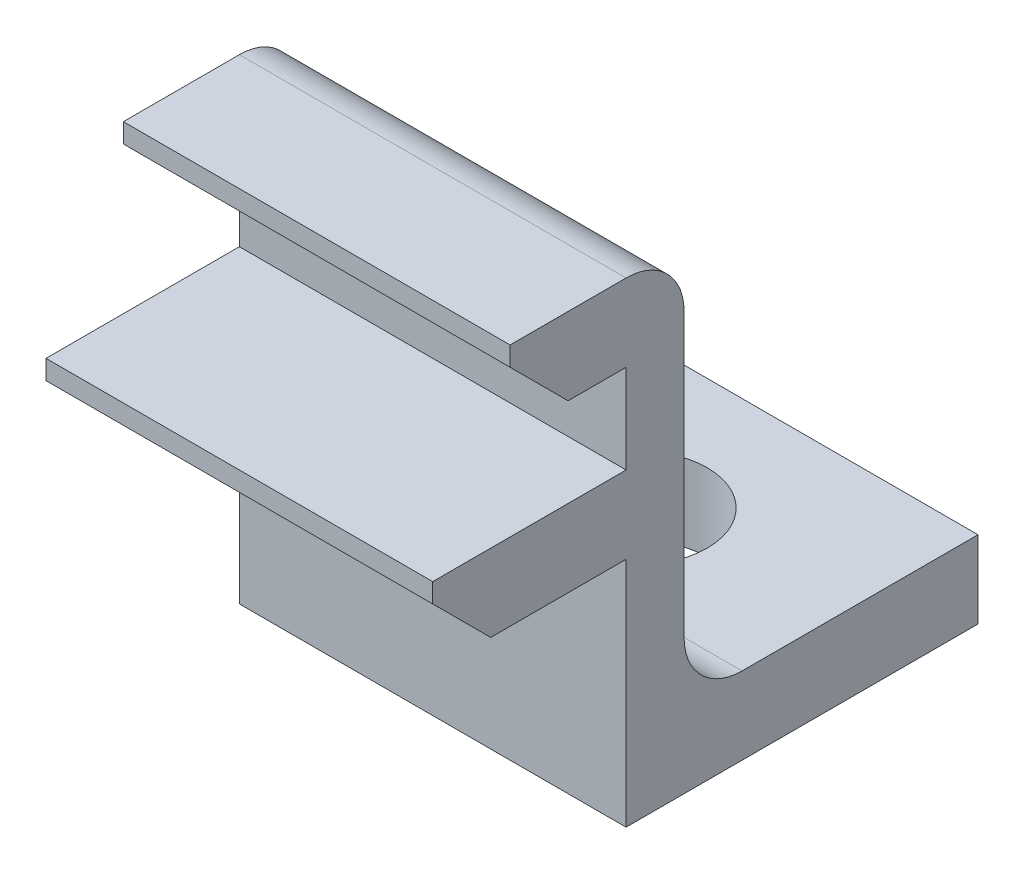
ISO-10303-21;
HEADER;
FILE_DESCRIPTION(('STEP AP214'),'2;1');
FILE_NAME('part.step','',(''),(''),'','','');
FILE_SCHEMA(('AUTOMOTIVE_DESIGN { 1 0 10303 214 1 1 1 1 }'));
ENDSEC;
DATA;
#1=APPLICATION_CONTEXT('core data for automotive mechanical design processes');
#2=APPLICATION_PROTOCOL_DEFINITION('international standard','automotive_design',2000,#1);
#3=PRODUCT_CONTEXT('',#1,'mechanical');
#4=PRODUCT('Part','Part','',(#3));
#5=PRODUCT_RELATED_PRODUCT_CATEGORY('part','',(#4));
#6=PRODUCT_DEFINITION_FORMATION('','',#4);
#7=PRODUCT_DEFINITION_CONTEXT('part definition',#1,'design');
#8=PRODUCT_DEFINITION('design','',#6,#7);
#9=PRODUCT_DEFINITION_SHAPE('','',#8);
#10=(LENGTH_UNIT() NAMED_UNIT(*) SI_UNIT(.MILLI.,.METRE.));
#11=(NAMED_UNIT(*) PLANE_ANGLE_UNIT() SI_UNIT($,.RADIAN.));
#12=(NAMED_UNIT(*) SI_UNIT($,.STERADIAN.) SOLID_ANGLE_UNIT());
#13=UNCERTAINTY_MEASURE_WITH_UNIT(LENGTH_MEASURE(1.E-05),#10,'distance_accuracy_value','');
#14=(GEOMETRIC_REPRESENTATION_CONTEXT(3) GLOBAL_UNCERTAINTY_ASSIGNED_CONTEXT((#13)) GLOBAL_UNIT_ASSIGNED_CONTEXT((#10,
#11,#12)) REPRESENTATION_CONTEXT('',''));
#15=CARTESIAN_POINT('',(0.,0.,0.));
#16=DIRECTION('',(0.,0.,1.));
#17=DIRECTION('',(1.,0.,0.));
#18=AXIS2_PLACEMENT_3D('',#15,#16,#17);
#19=CARTESIAN_POINT('',(5.,0.,-3.79999999999999));
#20=DIRECTION('',(0.,0.,-1.));
#21=DIRECTION('',(0.,1.,0.));
#22=AXIS2_PLACEMENT_3D('',#19,#20,#21);
#23=PLANE('',#22);
#24=DIRECTION('',(0.,-1.,0.));
#25=VECTOR('',#24,1.);
#26=CARTESIAN_POINT('',(-5.,0.,-3.79999999999999));
#27=LINE('',#26,#25);
#28=CARTESIAN_POINT('',(-5.,-5.15,-3.8));
#29=VERTEX_POINT('',#28);
#30=CARTESIAN_POINT('',(-5.,-7.15,-3.8));
#31=VERTEX_POINT('',#30);
#32=EDGE_CURVE('E177',#29,#31,#27,.T.);
#33=ORIENTED_EDGE('',*,*,#32,.F.);
#34=DIRECTION('',(-1.,0.,0.));
#35=VECTOR('',#34,1.);
#36=CARTESIAN_POINT('',(5.,-5.15,-3.8));
#37=LINE('',#36,#35);
#38=CARTESIAN_POINT('',(5.,-5.15,-3.8));
#39=VERTEX_POINT('',#38);
#40=EDGE_CURVE('E165',#39,#29,#37,.T.);
#41=ORIENTED_EDGE('',*,*,#40,.F.);
#42=DIRECTION('',(0.,-1.,0.));
#43=VECTOR('',#42,1.);
#44=CARTESIAN_POINT('',(5.,0.,-3.79999999999999));
#45=LINE('',#44,#43);
#46=CARTESIAN_POINT('',(5.,-7.15,-3.8));
#47=VERTEX_POINT('',#46);
#48=EDGE_CURVE('E172',#39,#47,#45,.T.);
#49=ORIENTED_EDGE('',*,*,#48,.T.);
#50=DIRECTION('',(-1.,0.,0.));
#51=VECTOR('',#50,1.);
#52=CARTESIAN_POINT('',(5.,-7.15,-3.8));
#53=LINE('',#52,#51);
#54=EDGE_CURVE('E216',#47,#31,#53,.T.);
#55=ORIENTED_EDGE('',*,*,#54,.T.);
#56=EDGE_LOOP('',(#33,#41,#49,#55));
#57=FACE_BOUND('',#56,.T.);
#58=ADVANCED_FACE('F46',(#57),#23,.T.);
#59=CARTESIAN_POINT('',(5.,-5.15,0.));
#60=DIRECTION('',(0.,1.,0.));
#61=DIRECTION('',(0.,0.,1.));
#62=AXIS2_PLACEMENT_3D('',#59,#60,#61);
#63=PLANE('',#62);
#64=CARTESIAN_POINT('',(0.,-5.15,0.));
#65=DIRECTION('',(0.,1.,0.));
#66=DIRECTION('',(0.,0.,1.));
#67=AXIS2_PLACEMENT_3D('',#64,#65,#66);
#68=CIRCLE('',#67,1.8);
#69=CARTESIAN_POINT('',(0.,-5.15,1.8));
#70=VERTEX_POINT('',#69);
#71=EDGE_CURVE('E191',#70,#70,#68,.T.);
#72=ORIENTED_EDGE('',*,*,#71,.F.);
#73=EDGE_LOOP('',(#72));
#74=FACE_BOUND('',#73,.T.);
#75=DIRECTION('',(0.,0.,-1.));
#76=VECTOR('',#75,1.);
#77=CARTESIAN_POINT('',(-5.,-5.15,0.));
#78=LINE('',#77,#76);
#79=CARTESIAN_POINT('',(-5.,-5.15,2.3));
#80=VERTEX_POINT('',#79);
#81=EDGE_CURVE('E218',#80,#29,#78,.T.);
#82=ORIENTED_EDGE('',*,*,#81,.F.);
#83=DIRECTION('',(-1.,0.,0.));
#84=VECTOR('',#83,1.);
#85=CARTESIAN_POINT('',(5.,-5.15,2.3));
#86=LINE('',#85,#84);
#87=CARTESIAN_POINT('',(5.,-5.15,2.3));
#88=VERTEX_POINT('',#87);
#89=EDGE_CURVE('E168',#80,#88,#86,.F.);
#90=ORIENTED_EDGE('',*,*,#89,.T.);
#91=DIRECTION('',(0.,0.,-1.));
#92=VECTOR('',#91,1.);
#93=CARTESIAN_POINT('',(5.,-5.15,0.));
#94=LINE('',#93,#92);
#95=EDGE_CURVE('E161',#88,#39,#94,.T.);
#96=ORIENTED_EDGE('',*,*,#95,.T.);
#97=ORIENTED_EDGE('',*,*,#40,.T.);
#98=EDGE_LOOP('',(#82,#90,#96,#97));
#99=FACE_BOUND('',#98,.T.);
#100=ADVANCED_FACE('F164',(#74,#99),#63,.T.);
#101=CARTESIAN_POINT('',(5.,0.,3.8));
#102=DIRECTION('',(0.,0.,-1.));
#103=DIRECTION('',(-1.,0.,0.));
#104=AXIS2_PLACEMENT_3D('',#101,#102,#103);
#105=PLANE('',#104);
#106=DIRECTION('',(0.,-1.,0.));
#107=VECTOR('',#106,1.);
#108=CARTESIAN_POINT('',(5.,0.,3.8));
#109=LINE('',#108,#107);
#110=CARTESIAN_POINT('',(5.,3.65,3.8));
#111=VERTEX_POINT('',#110);
#112=CARTESIAN_POINT('',(5.,-3.65,3.8));
#113=VERTEX_POINT('',#112);
#114=EDGE_CURVE('E171',#111,#113,#109,.T.);
#115=ORIENTED_EDGE('',*,*,#114,.T.);
#116=DIRECTION('',(-1.,0.,0.));
#117=VECTOR('',#116,1.);
#118=CARTESIAN_POINT('',(-5.,-3.65,3.8));
#119=LINE('',#118,#117);
#120=CARTESIAN_POINT('',(-5.,-3.65,3.8));
#121=VERTEX_POINT('',#120);
#122=EDGE_CURVE('E277',#113,#121,#119,.T.);
#123=ORIENTED_EDGE('',*,*,#122,.T.);
#124=DIRECTION('',(0.,-1.,0.));
#125=VECTOR('',#124,1.);
#126=CARTESIAN_POINT('',(-5.,0.,3.8));
#127=LINE('',#126,#125);
#128=CARTESIAN_POINT('',(-5.,3.65,3.8));
#129=VERTEX_POINT('',#128);
#130=EDGE_CURVE('E220',#129,#121,#127,.T.);
#131=ORIENTED_EDGE('',*,*,#130,.F.);
#132=DIRECTION('',(-1.,0.,0.));
#133=VECTOR('',#132,1.);
#134=CARTESIAN_POINT('',(5.,3.65,3.8));
#135=LINE('',#134,#133);
#136=EDGE_CURVE('E275',#129,#111,#135,.F.);
#137=ORIENTED_EDGE('',*,*,#136,.T.);
#138=EDGE_LOOP('',(#115,#123,#131,#137));
#139=FACE_BOUND('',#138,.T.);
#140=ADVANCED_FACE('F291',(#139),#105,.T.);
#141=CARTESIAN_POINT('',(5.,5.15,0.));
#142=DIRECTION('',(0.,1.,0.));
#143=DIRECTION('',(0.,0.,1.));
#144=AXIS2_PLACEMENT_3D('',#141,#142,#143);
#145=PLANE('',#144);
#146=DIRECTION('',(0.,0.,-1.));
#147=VECTOR('',#146,1.);
#148=CARTESIAN_POINT('',(5.,5.15,0.));
#149=LINE('',#148,#147);
#150=CARTESIAN_POINT('',(5.,5.15,8.3));
#151=VERTEX_POINT('',#150);
#152=CARTESIAN_POINT('',(5.,5.15,5.3));
#153=VERTEX_POINT('',#152);
#154=EDGE_CURVE('E196',#151,#153,#149,.T.);
#155=ORIENTED_EDGE('',*,*,#154,.T.);
#156=DIRECTION('',(-1.,0.,0.));
#157=VECTOR('',#156,1.);
#158=CARTESIAN_POINT('',(5.,5.15,5.3));
#159=LINE('',#158,#157);
#160=CARTESIAN_POINT('',(-5.,5.15,5.3));
#161=VERTEX_POINT('',#160);
#162=EDGE_CURVE('E281',#153,#161,#159,.T.);
#163=ORIENTED_EDGE('',*,*,#162,.T.);
#164=DIRECTION('',(0.,0.,-1.));
#165=VECTOR('',#164,1.);
#166=CARTESIAN_POINT('',(-5.,5.15,0.));
#167=LINE('',#166,#165);
#168=CARTESIAN_POINT('',(-5.,5.15,8.3));
#169=VERTEX_POINT('',#168);
#170=EDGE_CURVE('E223',#169,#161,#167,.T.);
#171=ORIENTED_EDGE('',*,*,#170,.F.);
#172=DIRECTION('',(-1.,0.,0.));
#173=VECTOR('',#172,1.);
#174=CARTESIAN_POINT('',(5.,5.15,8.3));
#175=LINE('',#174,#173);
#176=EDGE_CURVE('E179',#151,#169,#175,.T.);
#177=ORIENTED_EDGE('',*,*,#176,.F.);
#178=EDGE_LOOP('',(#155,#163,#171,#177));
#179=FACE_BOUND('',#178,.T.);
#180=ADVANCED_FACE('F294',(#179),#145,.T.);
#181=CARTESIAN_POINT('',(5.,0.,8.3));
#182=DIRECTION('',(0.,0.,-1.));
#183=DIRECTION('',(-1.,0.,0.));
#184=AXIS2_PLACEMENT_3D('',#181,#182,#183);
#185=PLANE('',#184);
#186=DIRECTION('',(0.,-1.,0.));
#187=VECTOR('',#186,1.);
#188=CARTESIAN_POINT('',(-5.,0.,8.3));
#189=LINE('',#188,#187);
#190=CARTESIAN_POINT('',(-5.,4.65000000000001,8.3));
#191=VERTEX_POINT('',#190);
#192=EDGE_CURVE('E226',#169,#191,#189,.T.);
#193=ORIENTED_EDGE('',*,*,#192,.T.);
#194=DIRECTION('',(1.,0.,0.));
#195=VECTOR('',#194,1.);
#196=CARTESIAN_POINT('',(5.,4.65000000000001,8.3));
#197=LINE('',#196,#195);
#198=CARTESIAN_POINT('',(5.,4.65000000000001,8.3));
#199=VERTEX_POINT('',#198);
#200=EDGE_CURVE('E264',#191,#199,#197,.T.);
#201=ORIENTED_EDGE('',*,*,#200,.T.);
#202=DIRECTION('',(0.,-1.,0.));
#203=VECTOR('',#202,1.);
#204=CARTESIAN_POINT('',(5.,0.,8.3));
#205=LINE('',#204,#203);
#206=EDGE_CURVE('E198',#151,#199,#205,.T.);
#207=ORIENTED_EDGE('',*,*,#206,.F.);
#208=ORIENTED_EDGE('',*,*,#176,.T.);
#209=EDGE_LOOP('',(#193,#201,#207,#208));
#210=FACE_BOUND('',#209,.T.);
#211=ADVANCED_FACE('F299',(#210),#185,.F.);
#212=CARTESIAN_POINT('',(5.,3.15,0.));
#213=DIRECTION('',(0.,1.,0.));
#214=DIRECTION('',(0.,0.,1.));
#215=AXIS2_PLACEMENT_3D('',#212,#213,#214);
#216=PLANE('',#215);
#217=DIRECTION('',(0.,0.,-1.));
#218=VECTOR('',#217,1.);
#219=CARTESIAN_POINT('',(5.,3.15,0.));
#220=LINE('',#219,#218);
#221=CARTESIAN_POINT('',(5.,3.15,6.8));
#222=VERTEX_POINT('',#221);
#223=CARTESIAN_POINT('',(5.,3.15,5.3));
#224=VERTEX_POINT('',#223);
#225=EDGE_CURVE('E201',#222,#224,#220,.T.);
#226=ORIENTED_EDGE('',*,*,#225,.F.);
#227=DIRECTION('',(-1.,0.,0.));
#228=VECTOR('',#227,1.);
#229=CARTESIAN_POINT('',(5.,3.15,6.8));
#230=LINE('',#229,#228);
#231=CARTESIAN_POINT('',(-5.,3.15,6.8));
#232=VERTEX_POINT('',#231);
#233=EDGE_CURVE('E178',#222,#232,#230,.T.);
#234=ORIENTED_EDGE('',*,*,#233,.T.);
#235=DIRECTION('',(0.,0.,-1.));
#236=VECTOR('',#235,1.);
#237=CARTESIAN_POINT('',(-5.,3.15,0.));
#238=LINE('',#237,#236);
#239=CARTESIAN_POINT('',(-5.,3.15,5.3));
#240=VERTEX_POINT('',#239);
#241=EDGE_CURVE('E229',#232,#240,#238,.T.);
#242=ORIENTED_EDGE('',*,*,#241,.T.);
#243=DIRECTION('',(-1.,0.,0.));
#244=VECTOR('',#243,1.);
#245=CARTESIAN_POINT('',(5.,3.15,5.3));
#246=LINE('',#245,#244);
#247=EDGE_CURVE('E254',#224,#240,#246,.T.);
#248=ORIENTED_EDGE('',*,*,#247,.F.);
#249=EDGE_LOOP('',(#226,#234,#242,#248));
#250=FACE_BOUND('',#249,.T.);
#251=ADVANCED_FACE('F308',(#250),#216,.F.);
#252=CARTESIAN_POINT('',(5.,0.,5.3));
#253=DIRECTION('',(0.,0.,-1.));
#254=DIRECTION('',(0.,1.,0.));
#255=AXIS2_PLACEMENT_3D('',#252,#253,#254);
#256=PLANE('',#255);
#257=DIRECTION('',(0.,-1.,0.));
#258=VECTOR('',#257,1.);
#259=CARTESIAN_POINT('',(-5.,0.,5.3));
#260=LINE('',#259,#258);
#261=CARTESIAN_POINT('',(-5.,0.850000000000001,5.3));
#262=VERTEX_POINT('',#261);
#263=EDGE_CURVE('E231',#240,#262,#260,.T.);
#264=ORIENTED_EDGE('',*,*,#263,.T.);
#265=DIRECTION('',(-1.,0.,0.));
#266=VECTOR('',#265,1.);
#267=CARTESIAN_POINT('',(5.,0.850000000000001,5.3));
#268=LINE('',#267,#266);
#269=CARTESIAN_POINT('',(5.,0.850000000000001,5.3));
#270=VERTEX_POINT('',#269);
#271=EDGE_CURVE('E252',#270,#262,#268,.T.);
#272=ORIENTED_EDGE('',*,*,#271,.F.);
#273=DIRECTION('',(0.,-1.,0.));
#274=VECTOR('',#273,1.);
#275=CARTESIAN_POINT('',(5.,0.,5.3));
#276=LINE('',#275,#274);
#277=EDGE_CURVE('E203',#224,#270,#276,.T.);
#278=ORIENTED_EDGE('',*,*,#277,.F.);
#279=ORIENTED_EDGE('',*,*,#247,.T.);
#280=EDGE_LOOP('',(#264,#272,#278,#279));
#281=FACE_BOUND('',#280,.T.);
#282=ADVANCED_FACE('F313',(#281),#256,.F.);
#283=CARTESIAN_POINT('',(5.,0.850000000000001,0.));
#284=DIRECTION('',(0.,1.,0.));
#285=DIRECTION('',(0.,0.,1.));
#286=AXIS2_PLACEMENT_3D('',#283,#284,#285);
#287=PLANE('',#286);
#288=DIRECTION('',(0.,0.,-1.));
#289=VECTOR('',#288,1.);
#290=CARTESIAN_POINT('',(-5.,0.850000000000001,0.));
#291=LINE('',#290,#289);
#292=CARTESIAN_POINT('',(-5.,0.850000000000001,10.3));
#293=VERTEX_POINT('',#292);
#294=EDGE_CURVE('E234',#293,#262,#291,.T.);
#295=ORIENTED_EDGE('',*,*,#294,.F.);
#296=DIRECTION('',(-1.,0.,0.));
#297=VECTOR('',#296,1.);
#298=CARTESIAN_POINT('',(5.,0.850000000000001,10.3));
#299=LINE('',#298,#297);
#300=CARTESIAN_POINT('',(5.,0.850000000000001,10.3));
#301=VERTEX_POINT('',#300);
#302=EDGE_CURVE('E250',#301,#293,#299,.T.);
#303=ORIENTED_EDGE('',*,*,#302,.F.);
#304=DIRECTION('',(0.,0.,-1.));
#305=VECTOR('',#304,1.);
#306=CARTESIAN_POINT('',(5.,0.850000000000001,0.));
#307=LINE('',#306,#305);
#308=EDGE_CURVE('E205',#301,#270,#307,.T.);
#309=ORIENTED_EDGE('',*,*,#308,.T.);
#310=ORIENTED_EDGE('',*,*,#271,.T.);
#311=EDGE_LOOP('',(#295,#303,#309,#310));
#312=FACE_BOUND('',#311,.T.);
#313=ADVANCED_FACE('F319',(#312),#287,.T.);
#314=CARTESIAN_POINT('',(5.,0.,10.3));
#315=DIRECTION('',(0.,0.,-1.));
#316=DIRECTION('',(0.,1.,0.));
#317=AXIS2_PLACEMENT_3D('',#314,#315,#316);
#318=PLANE('',#317);
#319=DIRECTION('',(0.,-1.,0.));
#320=VECTOR('',#319,1.);
#321=CARTESIAN_POINT('',(-5.,0.,10.3));
#322=LINE('',#321,#320);
#323=CARTESIAN_POINT('',(-5.,0.350000000000008,10.3));
#324=VERTEX_POINT('',#323);
#325=EDGE_CURVE('E237',#293,#324,#322,.T.);
#326=ORIENTED_EDGE('',*,*,#325,.T.);
#327=DIRECTION('',(1.,0.,0.));
#328=VECTOR('',#327,1.);
#329=CARTESIAN_POINT('',(5.,0.350000000000008,10.3));
#330=LINE('',#329,#328);
#331=CARTESIAN_POINT('',(5.,0.350000000000008,10.3));
#332=VERTEX_POINT('',#331);
#333=EDGE_CURVE('E273',#324,#332,#330,.T.);
#334=ORIENTED_EDGE('',*,*,#333,.T.);
#335=DIRECTION('',(0.,-1.,0.));
#336=VECTOR('',#335,1.);
#337=CARTESIAN_POINT('',(5.,0.,10.3));
#338=LINE('',#337,#336);
#339=EDGE_CURVE('E208',#301,#332,#338,.T.);
#340=ORIENTED_EDGE('',*,*,#339,.F.);
#341=ORIENTED_EDGE('',*,*,#302,.T.);
#342=EDGE_LOOP('',(#326,#334,#340,#341));
#343=FACE_BOUND('',#342,.T.);
#344=ADVANCED_FACE('F322',(#343),#318,.F.);
#345=CARTESIAN_POINT('',(5.,-1.15,0.));
#346=DIRECTION('',(0.,1.,0.));
#347=DIRECTION('',(0.,0.,1.));
#348=AXIS2_PLACEMENT_3D('',#345,#346,#347);
#349=PLANE('',#348);
#350=DIRECTION('',(0.,0.,-1.));
#351=VECTOR('',#350,1.);
#352=CARTESIAN_POINT('',(5.,-1.15,0.));
#353=LINE('',#352,#351);
#354=CARTESIAN_POINT('',(5.,-1.15,8.8));
#355=VERTEX_POINT('',#354);
#356=CARTESIAN_POINT('',(5.,-1.15,5.3));
#357=VERTEX_POINT('',#356);
#358=EDGE_CURVE('E211',#355,#357,#353,.T.);
#359=ORIENTED_EDGE('',*,*,#358,.F.);
#360=DIRECTION('',(-1.,0.,0.));
#361=VECTOR('',#360,1.);
#362=CARTESIAN_POINT('',(5.,-1.15,8.8));
#363=LINE('',#362,#361);
#364=CARTESIAN_POINT('',(-5.,-1.15,8.8));
#365=VERTEX_POINT('',#364);
#366=EDGE_CURVE('E270',#355,#365,#363,.T.);
#367=ORIENTED_EDGE('',*,*,#366,.T.);
#368=DIRECTION('',(0.,0.,-1.));
#369=VECTOR('',#368,1.);
#370=CARTESIAN_POINT('',(-5.,-1.15,0.));
#371=LINE('',#370,#369);
#372=CARTESIAN_POINT('',(-5.,-1.15,5.3));
#373=VERTEX_POINT('',#372);
#374=EDGE_CURVE('E240',#365,#373,#371,.T.);
#375=ORIENTED_EDGE('',*,*,#374,.T.);
#376=DIRECTION('',(-1.,0.,0.));
#377=VECTOR('',#376,1.);
#378=CARTESIAN_POINT('',(5.,-1.15,5.3));
#379=LINE('',#378,#377);
#380=EDGE_CURVE('E247',#357,#373,#379,.T.);
#381=ORIENTED_EDGE('',*,*,#380,.F.);
#382=EDGE_LOOP('',(#359,#367,#375,#381));
#383=FACE_BOUND('',#382,.T.);
#384=ADVANCED_FACE('F330',(#383),#349,.F.);
#385=CARTESIAN_POINT('',(5.,0.,5.3));
#386=DIRECTION('',(0.,0.,-1.));
#387=DIRECTION('',(0.,1.,0.));
#388=AXIS2_PLACEMENT_3D('',#385,#386,#387);
#389=PLANE('',#388);
#390=DIRECTION('',(0.,-1.,0.));
#391=VECTOR('',#390,1.);
#392=CARTESIAN_POINT('',(-5.,0.,5.3));
#393=LINE('',#392,#391);
#394=CARTESIAN_POINT('',(-5.,-7.15,5.3));
#395=VERTEX_POINT('',#394);
#396=EDGE_CURVE('E188',#373,#395,#393,.T.);
#397=ORIENTED_EDGE('',*,*,#396,.T.);
#398=DIRECTION('',(-1.,0.,0.));
#399=VECTOR('',#398,1.);
#400=CARTESIAN_POINT('',(5.,-7.15,5.3));
#401=LINE('',#400,#399);
#402=CARTESIAN_POINT('',(5.,-7.15,5.3));
#403=VERTEX_POINT('',#402);
#404=EDGE_CURVE('E244',#403,#395,#401,.T.);
#405=ORIENTED_EDGE('',*,*,#404,.F.);
#406=DIRECTION('',(0.,-1.,0.));
#407=VECTOR('',#406,1.);
#408=CARTESIAN_POINT('',(5.,0.,5.3));
#409=LINE('',#408,#407);
#410=EDGE_CURVE('E213',#357,#403,#409,.T.);
#411=ORIENTED_EDGE('',*,*,#410,.F.);
#412=ORIENTED_EDGE('',*,*,#380,.T.);
#413=EDGE_LOOP('',(#397,#405,#411,#412));
#414=FACE_BOUND('',#413,.T.);
#415=ADVANCED_FACE('F336',(#414),#389,.F.);
#416=CARTESIAN_POINT('',(5.,-7.15,0.));
#417=DIRECTION('',(0.,1.,0.));
#418=DIRECTION('',(0.,0.,1.));
#419=AXIS2_PLACEMENT_3D('',#416,#417,#418);
#420=PLANE('',#419);
#421=CARTESIAN_POINT('',(0.,-7.15,0.));
#422=DIRECTION('',(0.,-1.,0.));
#423=DIRECTION('',(0.,0.,-1.));
#424=AXIS2_PLACEMENT_3D('',#421,#422,#423);
#425=CIRCLE('',#424,1.8);
#426=CARTESIAN_POINT('',(0.,-7.15,-1.8));
#427=VERTEX_POINT('',#426);
#428=EDGE_CURVE('E506',#427,#427,#425,.T.);
#429=ORIENTED_EDGE('',*,*,#428,.F.);
#430=EDGE_LOOP('',(#429));
#431=FACE_BOUND('',#430,.T.);
#432=DIRECTION('',(0.,0.,-1.));
#433=VECTOR('',#432,1.);
#434=CARTESIAN_POINT('',(-5.,-7.15,0.));
#435=LINE('',#434,#433);
#436=EDGE_CURVE('E185',#395,#31,#435,.T.);
#437=ORIENTED_EDGE('',*,*,#436,.T.);
#438=ORIENTED_EDGE('',*,*,#54,.F.);
#439=DIRECTION('',(0.,0.,-1.));
#440=VECTOR('',#439,1.);
#441=CARTESIAN_POINT('',(5.,-7.15,0.));
#442=LINE('',#441,#440);
#443=EDGE_CURVE('E183',#403,#47,#442,.T.);
#444=ORIENTED_EDGE('',*,*,#443,.F.);
#445=ORIENTED_EDGE('',*,*,#404,.T.);
#446=EDGE_LOOP('',(#437,#438,#444,#445));
#447=FACE_BOUND('',#446,.T.);
#448=ADVANCED_FACE('F339',(#431,#447),#420,.F.);
#449=CARTESIAN_POINT('',(5.,0.,0.));
#450=DIRECTION('',(1.,0.,0.));
#451=DIRECTION('',(0.,0.,-1.));
#452=AXIS2_PLACEMENT_3D('',#449,#450,#451);
#453=PLANE('',#452);
#454=ORIENTED_EDGE('',*,*,#114,.F.);
#455=CARTESIAN_POINT('',(5.,3.65,5.3));
#456=DIRECTION('',(1.,0.,0.));
#457=DIRECTION('',(0.,0.,-1.));
#458=AXIS2_PLACEMENT_3D('',#455,#456,#457);
#459=CIRCLE('',#458,1.5);
#460=EDGE_CURVE('E61',#111,#153,#459,.T.);
#461=ORIENTED_EDGE('',*,*,#460,.T.);
#462=ORIENTED_EDGE('',*,*,#154,.F.);
#463=ORIENTED_EDGE('',*,*,#206,.T.);
#464=DIRECTION('',(0.,0.707106781186549,0.707106781186546));
#465=VECTOR('',#464,1.);
#466=CARTESIAN_POINT('',(5.,-1.82500000000001,1.82500000000001));
#467=LINE('',#466,#465);
#468=EDGE_CURVE('E268',#199,#222,#467,.F.);
#469=ORIENTED_EDGE('',*,*,#468,.T.);
#470=ORIENTED_EDGE('',*,*,#225,.T.);
#471=ORIENTED_EDGE('',*,*,#277,.T.);
#472=ORIENTED_EDGE('',*,*,#308,.F.);
#473=ORIENTED_EDGE('',*,*,#339,.T.);
#474=DIRECTION('',(0.,0.70710678118655,0.707106781186545));
#475=VECTOR('',#474,1.);
#476=CARTESIAN_POINT('',(5.,-4.975,4.97500000000003));
#477=LINE('',#476,#475);
#478=EDGE_CURVE('E266',#332,#355,#477,.F.);
#479=ORIENTED_EDGE('',*,*,#478,.T.);
#480=ORIENTED_EDGE('',*,*,#358,.T.);
#481=ORIENTED_EDGE('',*,*,#410,.T.);
#482=ORIENTED_EDGE('',*,*,#443,.T.);
#483=ORIENTED_EDGE('',*,*,#48,.F.);
#484=ORIENTED_EDGE('',*,*,#95,.F.);
#485=CARTESIAN_POINT('',(5.,-3.65,2.3));
#486=DIRECTION('',(1.,0.,0.));
#487=DIRECTION('',(0.,0.,-1.));
#488=AXIS2_PLACEMENT_3D('',#485,#486,#487);
#489=CIRCLE('',#488,1.5);
#490=EDGE_CURVE('E12',#88,#113,#489,.F.);
#491=ORIENTED_EDGE('',*,*,#490,.T.);
#492=EDGE_LOOP('',(#454,#461,#462,#463,#469,#470,#471,#472,#473,#479,#480,#481,#482,#483,#484,#491));
#493=FACE_BOUND('',#492,.T.);
#494=ADVANCED_FACE('F181',(#493),#453,.T.);
#495=CARTESIAN_POINT('',(-5.,0.,0.));
#496=DIRECTION('',(1.,0.,0.));
#497=DIRECTION('',(0.,0.,-1.));
#498=AXIS2_PLACEMENT_3D('',#495,#496,#497);
#499=PLANE('',#498);
#500=ORIENTED_EDGE('',*,*,#170,.T.);
#501=CARTESIAN_POINT('',(-5.,3.65,5.3));
#502=DIRECTION('',(1.,0.,0.));
#503=DIRECTION('',(0.,0.,-1.));
#504=AXIS2_PLACEMENT_3D('',#501,#502,#503);
#505=CIRCLE('',#504,1.5);
#506=EDGE_CURVE('E69',#161,#129,#505,.F.);
#507=ORIENTED_EDGE('',*,*,#506,.T.);
#508=ORIENTED_EDGE('',*,*,#130,.T.);
#509=CARTESIAN_POINT('',(-5.,-3.65,2.3));
#510=DIRECTION('',(1.,0.,0.));
#511=DIRECTION('',(0.,0.,-1.));
#512=AXIS2_PLACEMENT_3D('',#509,#510,#511);
#513=CIRCLE('',#512,1.5);
#514=EDGE_CURVE('E54',#121,#80,#513,.T.);
#515=ORIENTED_EDGE('',*,*,#514,.T.);
#516=ORIENTED_EDGE('',*,*,#81,.T.);
#517=ORIENTED_EDGE('',*,*,#32,.T.);
#518=ORIENTED_EDGE('',*,*,#436,.F.);
#519=ORIENTED_EDGE('',*,*,#396,.F.);
#520=ORIENTED_EDGE('',*,*,#374,.F.);
#521=DIRECTION('',(0.,-0.70710678118655,-0.707106781186545));
#522=VECTOR('',#521,1.);
#523=CARTESIAN_POINT('',(-5.,-1.15,8.8));
#524=LINE('',#523,#522);
#525=EDGE_CURVE('E260',#365,#324,#524,.F.);
#526=ORIENTED_EDGE('',*,*,#525,.T.);
#527=ORIENTED_EDGE('',*,*,#325,.F.);
#528=ORIENTED_EDGE('',*,*,#294,.T.);
#529=ORIENTED_EDGE('',*,*,#263,.F.);
#530=ORIENTED_EDGE('',*,*,#241,.F.);
#531=DIRECTION('',(0.,-0.707106781186549,-0.707106781186546));
#532=VECTOR('',#531,1.);
#533=CARTESIAN_POINT('',(-5.,3.15,6.8));
#534=LINE('',#533,#532);
#535=EDGE_CURVE('E262',#232,#191,#534,.F.);
#536=ORIENTED_EDGE('',*,*,#535,.T.);
#537=ORIENTED_EDGE('',*,*,#192,.F.);
#538=EDGE_LOOP('',(#500,#507,#508,#515,#516,#517,#518,#519,#520,#526,#527,#528,#529,#530,#536,#537));
#539=FACE_BOUND('',#538,.T.);
#540=ADVANCED_FACE('F285',(#539),#499,.F.);
#541=CARTESIAN_POINT('',(0.,5.15,0.));
#542=DIRECTION('',(0.,-1.,0.));
#543=DIRECTION('',(0.,0.,-1.));
#544=AXIS2_PLACEMENT_3D('',#541,#542,#543);
#545=CYLINDRICAL_SURFACE('',#544,1.8);
#546=ORIENTED_EDGE('',*,*,#71,.T.);
#547=EDGE_LOOP('',(#546));
#548=FACE_BOUND('',#547,.T.);
#549=ORIENTED_EDGE('',*,*,#428,.T.);
#550=EDGE_LOOP('',(#549));
#551=FACE_BOUND('',#550,.T.);
#552=ADVANCED_FACE('F366',(#548,#551),#545,.F.);
#553=CARTESIAN_POINT('',(5.,3.15,6.8));
#554=DIRECTION('',(0.,0.707106781186546,-0.707106781186549));
#555=DIRECTION('',(-1.,0.,0.));
#556=AXIS2_PLACEMENT_3D('',#553,#554,#555);
#557=PLANE('',#556);
#558=ORIENTED_EDGE('',*,*,#468,.F.);
#559=ORIENTED_EDGE('',*,*,#200,.F.);
#560=ORIENTED_EDGE('',*,*,#535,.F.);
#561=ORIENTED_EDGE('',*,*,#233,.F.);
#562=EDGE_LOOP('',(#558,#559,#560,#561));
#563=FACE_BOUND('',#562,.T.);
#564=ADVANCED_FACE('F303',(#563),#557,.F.);
#565=CARTESIAN_POINT('',(5.,-1.15,8.8));
#566=DIRECTION('',(0.,0.707106781186545,-0.70710678118655));
#567=DIRECTION('',(-1.,0.,0.));
#568=AXIS2_PLACEMENT_3D('',#565,#566,#567);
#569=PLANE('',#568);
#570=ORIENTED_EDGE('',*,*,#478,.F.);
#571=ORIENTED_EDGE('',*,*,#333,.F.);
#572=ORIENTED_EDGE('',*,*,#525,.F.);
#573=ORIENTED_EDGE('',*,*,#366,.F.);
#574=EDGE_LOOP('',(#570,#571,#572,#573));
#575=FACE_BOUND('',#574,.T.);
#576=ADVANCED_FACE('F325',(#575),#569,.F.);
#577=CARTESIAN_POINT('',(5.,-3.65,2.3));
#578=DIRECTION('',(1.,0.,0.));
#579=DIRECTION('',(0.,0.,-1.));
#580=AXIS2_PLACEMENT_3D('',#577,#578,#579);
#581=CYLINDRICAL_SURFACE('',#580,1.5);
#582=ORIENTED_EDGE('',*,*,#490,.F.);
#583=ORIENTED_EDGE('',*,*,#89,.F.);
#584=ORIENTED_EDGE('',*,*,#514,.F.);
#585=ORIENTED_EDGE('',*,*,#122,.F.);
#586=EDGE_LOOP('',(#582,#583,#584,#585));
#587=FACE_BOUND('',#586,.T.);
#588=ADVANCED_FACE('F289',(#587),#581,.F.);
#589=CARTESIAN_POINT('',(5.,3.65,5.3));
#590=DIRECTION('',(-1.,0.,0.));
#591=DIRECTION('',(0.,0.,1.));
#592=AXIS2_PLACEMENT_3D('',#589,#590,#591);
#593=CYLINDRICAL_SURFACE('',#592,1.5);
#594=ORIENTED_EDGE('',*,*,#460,.F.);
#595=ORIENTED_EDGE('',*,*,#136,.F.);
#596=ORIENTED_EDGE('',*,*,#506,.F.);
#597=ORIENTED_EDGE('',*,*,#162,.F.);
#598=EDGE_LOOP('',(#594,#595,#596,#597));
#599=FACE_BOUND('',#598,.T.);
#600=ADVANCED_FACE('F48',(#599),#593,.T.);
#601=CLOSED_SHELL('',(#58,#100,#140,#180,#211,#251,#282,#313,#344,#384,#415,#448,#494,#540,#552,
#564,#576,#588,#600));
#602=MANIFOLD_SOLID_BREP('B2',#601);
#603=ADVANCED_BREP_SHAPE_REPRESENTATION('',(#18,#602),#14);
#604=SHAPE_DEFINITION_REPRESENTATION(#9,#603);
ENDSEC;
END-ISO-10303-21;
